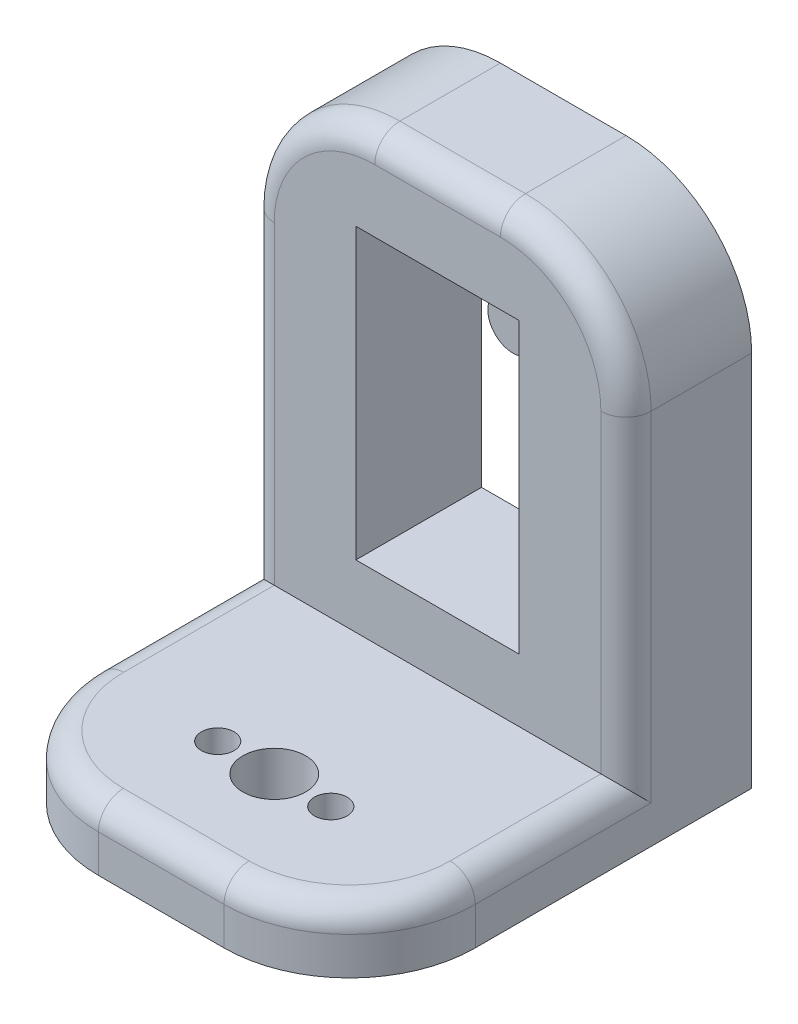
ISO-10303-21;
HEADER;
FILE_DESCRIPTION(('STEP AP214'),'2;1');
FILE_NAME('part.step','',(''),(''),'','','');
FILE_SCHEMA(('AUTOMOTIVE_DESIGN { 1 0 10303 214 1 1 1 1 }'));
ENDSEC;
DATA;
#1=APPLICATION_CONTEXT('core data for automotive mechanical design processes');
#2=APPLICATION_PROTOCOL_DEFINITION('international standard','automotive_design',2000,#1);
#3=PRODUCT_CONTEXT('',#1,'mechanical');
#4=PRODUCT('Part','Part','',(#3));
#5=PRODUCT_RELATED_PRODUCT_CATEGORY('part','',(#4));
#6=PRODUCT_DEFINITION_FORMATION('','',#4);
#7=PRODUCT_DEFINITION_CONTEXT('part definition',#1,'design');
#8=PRODUCT_DEFINITION('design','',#6,#7);
#9=PRODUCT_DEFINITION_SHAPE('','',#8);
#10=(LENGTH_UNIT() NAMED_UNIT(*) SI_UNIT(.MILLI.,.METRE.));
#11=(NAMED_UNIT(*) PLANE_ANGLE_UNIT() SI_UNIT($,.RADIAN.));
#12=(NAMED_UNIT(*) SI_UNIT($,.STERADIAN.) SOLID_ANGLE_UNIT());
#13=UNCERTAINTY_MEASURE_WITH_UNIT(LENGTH_MEASURE(1.E-05),#10,'distance_accuracy_value','');
#14=(GEOMETRIC_REPRESENTATION_CONTEXT(3) GLOBAL_UNCERTAINTY_ASSIGNED_CONTEXT((#13)) GLOBAL_UNIT_ASSIGNED_CONTEXT((#10,
#11,#12)) REPRESENTATION_CONTEXT('',''));
#15=CARTESIAN_POINT('',(0.,0.,0.));
#16=DIRECTION('',(0.,0.,1.));
#17=DIRECTION('',(1.,0.,0.));
#18=AXIS2_PLACEMENT_3D('',#15,#16,#17);
#19=CARTESIAN_POINT('',(15.,26.5,-34.));
#20=DIRECTION('',(0.,0.,-1.));
#21=DIRECTION('',(-1.,0.,0.));
#22=AXIS2_PLACEMENT_3D('',#19,#20,#21);
#23=CYLINDRICAL_SURFACE('',#22,2.);
#24=CARTESIAN_POINT('',(15.,26.5,-34.));
#25=DIRECTION('',(0.,0.,-1.));
#26=DIRECTION('',(-1.,0.,0.));
#27=AXIS2_PLACEMENT_3D('',#24,#25,#26);
#28=CIRCLE('',#27,2.);
#29=CARTESIAN_POINT('',(13.,26.5,-34.));
#30=VERTEX_POINT('',#29);
#31=EDGE_CURVE('E11',#30,#30,#28,.T.);
#32=ORIENTED_EDGE('',*,*,#31,.T.);
#33=EDGE_LOOP('',(#32));
#34=FACE_BOUND('',#33,.T.);
#35=CARTESIAN_POINT('',(15.,26.5,-38.));
#36=DIRECTION('',(0.,0.,-1.));
#37=DIRECTION('',(-1.,0.,0.));
#38=AXIS2_PLACEMENT_3D('',#35,#36,#37);
#39=CIRCLE('',#38,2.);
#40=CARTESIAN_POINT('',(13.,26.5,-38.));
#41=VERTEX_POINT('',#40);
#42=EDGE_CURVE('E47',#41,#41,#39,.T.);
#43=ORIENTED_EDGE('',*,*,#42,.F.);
#44=EDGE_LOOP('',(#43));
#45=FACE_BOUND('',#44,.T.);
#46=ADVANCED_FACE('F44',(#34,#45),#23,.T.);
#47=CARTESIAN_POINT('',(0.,0.,-34.));
#48=DIRECTION('',(0.,0.,-1.));
#49=DIRECTION('',(-1.,0.,0.));
#50=AXIS2_PLACEMENT_3D('',#47,#48,#49);
#51=PLANE('',#50);
#52=ORIENTED_EDGE('',*,*,#31,.F.);
#53=EDGE_LOOP('',(#52));
#54=FACE_BOUND('',#53,.T.);
#55=ADVANCED_FACE('F59',(#54),#51,.F.);
#56=CARTESIAN_POINT('',(0.,0.,-38.));
#57=DIRECTION('',(0.,0.,-1.));
#58=DIRECTION('',(-1.,0.,0.));
#59=AXIS2_PLACEMENT_3D('',#56,#57,#58);
#60=PLANE('',#59);
#61=ORIENTED_EDGE('',*,*,#42,.T.);
#62=EDGE_LOOP('',(#61));
#63=FACE_BOUND('',#62,.T.);
#64=ADVANCED_FACE('F56',(#63),#60,.T.);
#65=CLOSED_SHELL('',(#46,#55,#64));
#66=MANIFOLD_SOLID_BREP('B2',#65);
#67=CARTESIAN_POINT('',(-41.2310562561766,0.,-38.));
#68=DIRECTION('',(0.,0.,-1.));
#69=DIRECTION('',(-1.,0.,0.));
#70=AXIS2_PLACEMENT_3D('',#67,#68,#69);
#71=PLANE('',#70);
#72=CARTESIAN_POINT('',(15.,35.5,-38.));
#73=DIRECTION('',(0.,0.,-1.));
#74=DIRECTION('',(-1.,0.,0.));
#75=AXIS2_PLACEMENT_3D('',#72,#73,#74);
#76=CIRCLE('',#75,1.05);
#77=CARTESIAN_POINT('',(13.95,35.5,-38.));
#78=VERTEX_POINT('',#77);
#79=EDGE_CURVE('E246',#78,#78,#76,.T.);
#80=ORIENTED_EDGE('',*,*,#79,.F.);
#81=EDGE_LOOP('',(#80));
#82=FACE_BOUND('',#81,.T.);
#83=CARTESIAN_POINT('',(15.,7.5,-38.));
#84=DIRECTION('',(0.,0.,-1.));
#85=DIRECTION('',(-1.,0.,0.));
#86=AXIS2_PLACEMENT_3D('',#83,#84,#85);
#87=CIRCLE('',#86,1.05);
#88=CARTESIAN_POINT('',(13.95,7.5,-38.));
#89=VERTEX_POINT('',#88);
#90=EDGE_CURVE('E405',#89,#89,#87,.T.);
#91=ORIENTED_EDGE('',*,*,#90,.F.);
#92=EDGE_LOOP('',(#91));
#93=FACE_BOUND('',#92,.T.);
#94=DIRECTION('',(0.,1.,0.));
#95=VECTOR('',#94,1.);
#96=CARTESIAN_POINT('',(0.,0.,-38.));
#97=LINE('',#96,#95);
#98=CARTESIAN_POINT('',(0.,0.,-38.));
#99=VERTEX_POINT('',#98);
#100=CARTESIAN_POINT('',(0.,30.,-38.));
#101=VERTEX_POINT('',#100);
#102=EDGE_CURVE('E262',#99,#101,#97,.T.);
#103=ORIENTED_EDGE('',*,*,#102,.T.);
#104=CARTESIAN_POINT('',(10.,30.,-38.));
#105=DIRECTION('',(0.,0.,-1.));
#106=DIRECTION('',(-1.,0.,0.));
#107=AXIS2_PLACEMENT_3D('',#104,#105,#106);
#108=CIRCLE('',#107,10.);
#109=CARTESIAN_POINT('',(10.,40.,-38.));
#110=VERTEX_POINT('',#109);
#111=EDGE_CURVE('E314',#101,#110,#108,.T.);
#112=ORIENTED_EDGE('',*,*,#111,.T.);
#113=DIRECTION('',(1.,0.,0.));
#114=VECTOR('',#113,1.);
#115=CARTESIAN_POINT('',(-41.2310562561766,40.,-38.));
#116=LINE('',#115,#114);
#117=CARTESIAN_POINT('',(20.,40.,-38.));
#118=VERTEX_POINT('',#117);
#119=EDGE_CURVE('E265',#110,#118,#116,.T.);
#120=ORIENTED_EDGE('',*,*,#119,.T.);
#121=CARTESIAN_POINT('',(20.,30.,-38.));
#122=DIRECTION('',(0.,0.,-1.));
#123=DIRECTION('',(-1.,0.,0.));
#124=AXIS2_PLACEMENT_3D('',#121,#122,#123);
#125=CIRCLE('',#124,10.);
#126=CARTESIAN_POINT('',(30.,30.,-38.));
#127=VERTEX_POINT('',#126);
#128=EDGE_CURVE('E312',#118,#127,#125,.T.);
#129=ORIENTED_EDGE('',*,*,#128,.T.);
#130=DIRECTION('',(0.,1.,0.));
#131=VECTOR('',#130,1.);
#132=CARTESIAN_POINT('',(30.,0.,-38.));
#133=LINE('',#132,#131);
#134=CARTESIAN_POINT('',(30.,0.,-38.));
#135=VERTEX_POINT('',#134);
#136=EDGE_CURVE('E228',#135,#127,#133,.T.);
#137=ORIENTED_EDGE('',*,*,#136,.F.);
#138=DIRECTION('',(1.,0.,0.));
#139=VECTOR('',#138,1.);
#140=CARTESIAN_POINT('',(-41.2310562561766,0.,-38.));
#141=LINE('',#140,#139);
#142=EDGE_CURVE('E261',#99,#135,#141,.T.);
#143=ORIENTED_EDGE('',*,*,#142,.F.);
#144=EDGE_LOOP('',(#103,#112,#120,#129,#137,#143));
#145=FACE_BOUND('',#144,.T.);
#146=DIRECTION('',(0.,-1.,0.));
#147=VECTOR('',#146,1.);
#148=CARTESIAN_POINT('',(21.5,33.,-38.));
#149=LINE('',#148,#147);
#150=CARTESIAN_POINT('',(21.5,33.,-38.));
#151=VERTEX_POINT('',#150);
#152=CARTESIAN_POINT('',(21.5,10.,-38.));
#153=VERTEX_POINT('',#152);
#154=EDGE_CURVE('E242',#151,#153,#149,.T.);
#155=ORIENTED_EDGE('',*,*,#154,.F.);
#156=DIRECTION('',(-1.,0.,0.));
#157=VECTOR('',#156,1.);
#158=CARTESIAN_POINT('',(21.5,33.,-38.));
#159=LINE('',#158,#157);
#160=CARTESIAN_POINT('',(8.49999999999999,33.,-38.));
#161=VERTEX_POINT('',#160);
#162=EDGE_CURVE('E222',#151,#161,#159,.T.);
#163=ORIENTED_EDGE('',*,*,#162,.T.);
#164=DIRECTION('',(0.,-1.,0.));
#165=VECTOR('',#164,1.);
#166=CARTESIAN_POINT('',(8.49999999999999,33.,-38.));
#167=LINE('',#166,#165);
#168=CARTESIAN_POINT('',(8.49999999999999,9.99999999999999,-38.));
#169=VERTEX_POINT('',#168);
#170=EDGE_CURVE('E232',#161,#169,#167,.T.);
#171=ORIENTED_EDGE('',*,*,#170,.T.);
#172=DIRECTION('',(-1.,0.,0.));
#173=VECTOR('',#172,1.);
#174=CARTESIAN_POINT('',(21.5,10.,-38.));
#175=LINE('',#174,#173);
#176=EDGE_CURVE('E238',#153,#169,#175,.T.);
#177=ORIENTED_EDGE('',*,*,#176,.F.);
#178=EDGE_LOOP('',(#155,#163,#171,#177));
#179=FACE_BOUND('',#178,.T.);
#180=ADVANCED_FACE('F84',(#82,#93,#145,#179),#71,.T.);
#181=CARTESIAN_POINT('',(-41.2310562561766,0.,-28.));
#182=DIRECTION('',(0.,0.,1.));
#183=DIRECTION('',(1.,0.,0.));
#184=AXIS2_PLACEMENT_3D('',#181,#182,#183);
#185=PLANE('',#184);
#186=CARTESIAN_POINT('',(10.,30.,-28.));
#187=DIRECTION('',(0.,0.,1.));
#188=DIRECTION('',(1.,0.,0.));
#189=AXIS2_PLACEMENT_3D('',#186,#187,#188);
#190=CIRCLE('',#189,8.);
#191=CARTESIAN_POINT('',(10.,38.,-28.));
#192=VERTEX_POINT('',#191);
#193=CARTESIAN_POINT('',(2.,30.,-28.));
#194=VERTEX_POINT('',#193);
#195=EDGE_CURVE('E360',#192,#194,#190,.T.);
#196=ORIENTED_EDGE('',*,*,#195,.T.);
#197=DIRECTION('',(0.,-1.,0.));
#198=VECTOR('',#197,1.);
#199=CARTESIAN_POINT('',(2.,0.,-28.));
#200=LINE('',#199,#198);
#201=CARTESIAN_POINT('',(2.,5.,-28.));
#202=VERTEX_POINT('',#201);
#203=EDGE_CURVE('E362',#194,#202,#200,.T.);
#204=ORIENTED_EDGE('',*,*,#203,.T.);
#205=DIRECTION('',(1.,0.,0.));
#206=VECTOR('',#205,1.);
#207=CARTESIAN_POINT('',(0.,5.,-28.));
#208=LINE('',#207,#206);
#209=CARTESIAN_POINT('',(28.,5.,-28.));
#210=VERTEX_POINT('',#209);
#211=EDGE_CURVE('E268',#202,#210,#208,.T.);
#212=ORIENTED_EDGE('',*,*,#211,.T.);
#213=DIRECTION('',(0.,-1.,0.));
#214=VECTOR('',#213,1.);
#215=CARTESIAN_POINT('',(28.,30.,-28.));
#216=LINE('',#215,#214);
#217=CARTESIAN_POINT('',(28.,30.,-28.));
#218=VERTEX_POINT('',#217);
#219=EDGE_CURVE('E354',#210,#218,#216,.F.);
#220=ORIENTED_EDGE('',*,*,#219,.T.);
#221=CARTESIAN_POINT('',(20.,30.,-28.));
#222=DIRECTION('',(0.,0.,1.));
#223=DIRECTION('',(1.,0.,0.));
#224=AXIS2_PLACEMENT_3D('',#221,#222,#223);
#225=CIRCLE('',#224,8.);
#226=CARTESIAN_POINT('',(20.,38.,-28.));
#227=VERTEX_POINT('',#226);
#228=EDGE_CURVE('E356',#218,#227,#225,.T.);
#229=ORIENTED_EDGE('',*,*,#228,.T.);
#230=DIRECTION('',(1.,0.,0.));
#231=VECTOR('',#230,1.);
#232=CARTESIAN_POINT('',(-41.2310562561766,38.,-28.));
#233=LINE('',#232,#231);
#234=EDGE_CURVE('E358',#227,#192,#233,.F.);
#235=ORIENTED_EDGE('',*,*,#234,.T.);
#236=EDGE_LOOP('',(#196,#204,#212,#220,#229,#235));
#237=FACE_BOUND('',#236,.T.);
#238=DIRECTION('',(0.,1.,0.));
#239=VECTOR('',#238,1.);
#240=CARTESIAN_POINT('',(8.49999999999999,0.,-28.));
#241=LINE('',#240,#239);
#242=CARTESIAN_POINT('',(8.49999999999999,9.99999999999999,-28.));
#243=VERTEX_POINT('',#242);
#244=CARTESIAN_POINT('',(8.49999999999999,33.,-28.));
#245=VERTEX_POINT('',#244);
#246=EDGE_CURVE('E300',#243,#245,#241,.T.);
#247=ORIENTED_EDGE('',*,*,#246,.T.);
#248=DIRECTION('',(1.,0.,0.));
#249=VECTOR('',#248,1.);
#250=CARTESIAN_POINT('',(-41.2310562561766,33.,-28.));
#251=LINE('',#250,#249);
#252=CARTESIAN_POINT('',(21.5,33.,-28.));
#253=VERTEX_POINT('',#252);
#254=EDGE_CURVE('E225',#245,#253,#251,.T.);
#255=ORIENTED_EDGE('',*,*,#254,.T.);
#256=DIRECTION('',(0.,1.,0.));
#257=VECTOR('',#256,1.);
#258=CARTESIAN_POINT('',(21.5,0.,-28.));
#259=LINE('',#258,#257);
#260=CARTESIAN_POINT('',(21.5,10.,-28.));
#261=VERTEX_POINT('',#260);
#262=EDGE_CURVE('E284',#261,#253,#259,.T.);
#263=ORIENTED_EDGE('',*,*,#262,.F.);
#264=DIRECTION('',(1.,0.,0.));
#265=VECTOR('',#264,1.);
#266=CARTESIAN_POINT('',(-41.2310562561766,9.99999999999999,-28.));
#267=LINE('',#266,#265);
#268=EDGE_CURVE('E297',#243,#261,#267,.T.);
#269=ORIENTED_EDGE('',*,*,#268,.F.);
#270=EDGE_LOOP('',(#247,#255,#263,#269));
#271=FACE_BOUND('',#270,.T.);
#272=ADVANCED_FACE('F415',(#237,#271),#185,.T.);
#273=CARTESIAN_POINT('',(30.,5.,0.));
#274=DIRECTION('',(-1.,0.,0.));
#275=DIRECTION('',(0.,0.,1.));
#276=AXIS2_PLACEMENT_3D('',#273,#274,#275);
#277=PLANE('',#276);
#278=DIRECTION('',(0.,-1.,0.));
#279=VECTOR('',#278,1.);
#280=CARTESIAN_POINT('',(30.,5.,-30.));
#281=LINE('',#280,#279);
#282=CARTESIAN_POINT('',(30.,30.,-30.));
#283=VERTEX_POINT('',#282);
#284=CARTESIAN_POINT('',(30.,3.,-30.));
#285=VERTEX_POINT('',#284);
#286=EDGE_CURVE('E341',#283,#285,#281,.T.);
#287=ORIENTED_EDGE('',*,*,#286,.T.);
#288=DIRECTION('',(0.,0.,-1.));
#289=VECTOR('',#288,1.);
#290=CARTESIAN_POINT('',(30.,3.,-16.));
#291=LINE('',#290,#289);
#292=CARTESIAN_POINT('',(30.,3.,-16.));
#293=VERTEX_POINT('',#292);
#294=EDGE_CURVE('E343',#285,#293,#291,.F.);
#295=ORIENTED_EDGE('',*,*,#294,.T.);
#296=DIRECTION('',(0.,1.,0.));
#297=VECTOR('',#296,1.);
#298=CARTESIAN_POINT('',(30.,5.,-16.));
#299=LINE('',#298,#297);
#300=CARTESIAN_POINT('',(30.,0.,-16.));
#301=VERTEX_POINT('',#300);
#302=EDGE_CURVE('E316',#293,#301,#299,.F.);
#303=ORIENTED_EDGE('',*,*,#302,.T.);
#304=DIRECTION('',(0.,0.,-1.));
#305=VECTOR('',#304,1.);
#306=CARTESIAN_POINT('',(30.,0.,0.));
#307=LINE('',#306,#305);
#308=EDGE_CURVE('E293',#301,#135,#307,.T.);
#309=ORIENTED_EDGE('',*,*,#308,.T.);
#310=ORIENTED_EDGE('',*,*,#136,.T.);
#311=DIRECTION('',(0.,0.,1.));
#312=VECTOR('',#311,1.);
#313=CARTESIAN_POINT('',(30.,30.,-28.));
#314=LINE('',#313,#312);
#315=EDGE_CURVE('E318',#127,#283,#314,.T.);
#316=ORIENTED_EDGE('',*,*,#315,.T.);
#317=EDGE_LOOP('',(#287,#295,#303,#309,#310,#316));
#318=FACE_BOUND('',#317,.T.);
#319=ADVANCED_FACE('F444',(#318),#277,.F.);
#320=CARTESIAN_POINT('',(15.,5.,-15.));
#321=DIRECTION('',(0.,-1.,0.));
#322=DIRECTION('',(0.,0.,-1.));
#323=AXIS2_PLACEMENT_3D('',#320,#321,#322);
#324=CYLINDRICAL_SURFACE('',#323,2.5);
#325=CARTESIAN_POINT('',(15.,5.,-15.));
#326=DIRECTION('',(0.,1.,0.));
#327=DIRECTION('',(0.,0.,1.));
#328=AXIS2_PLACEMENT_3D('',#325,#326,#327);
#329=CIRCLE('',#328,2.5);
#330=CARTESIAN_POINT('',(15.,5.,-12.5));
#331=VERTEX_POINT('',#330);
#332=EDGE_CURVE('E281',#331,#331,#329,.T.);
#333=ORIENTED_EDGE('',*,*,#332,.T.);
#334=EDGE_LOOP('',(#333));
#335=FACE_BOUND('',#334,.T.);
#336=CARTESIAN_POINT('',(15.,0.,-15.));
#337=DIRECTION('',(0.,1.,0.));
#338=DIRECTION('',(0.,0.,1.));
#339=AXIS2_PLACEMENT_3D('',#336,#337,#338);
#340=CIRCLE('',#339,2.5);
#341=CARTESIAN_POINT('',(15.,0.,-12.5));
#342=VERTEX_POINT('',#341);
#343=EDGE_CURVE('E290',#342,#342,#340,.T.);
#344=ORIENTED_EDGE('',*,*,#343,.F.);
#345=EDGE_LOOP('',(#344));
#346=FACE_BOUND('',#345,.T.);
#347=ADVANCED_FACE('F539',(#335,#346),#324,.F.);
#348=CARTESIAN_POINT('',(10.5,5.,-15.));
#349=DIRECTION('',(0.,-1.,0.));
#350=DIRECTION('',(0.,0.,-1.));
#351=AXIS2_PLACEMENT_3D('',#348,#349,#350);
#352=CYLINDRICAL_SURFACE('',#351,1.3);
#353=CARTESIAN_POINT('',(10.5,5.,-15.));
#354=DIRECTION('',(0.,1.,0.));
#355=DIRECTION('',(0.,0.,1.));
#356=AXIS2_PLACEMENT_3D('',#353,#354,#355);
#357=CIRCLE('',#356,1.3);
#358=CARTESIAN_POINT('',(10.5,5.,-13.7));
#359=VERTEX_POINT('',#358);
#360=EDGE_CURVE('E277',#359,#359,#357,.T.);
#361=ORIENTED_EDGE('',*,*,#360,.T.);
#362=EDGE_LOOP('',(#361));
#363=FACE_BOUND('',#362,.T.);
#364=CARTESIAN_POINT('',(10.5,0.,-15.));
#365=DIRECTION('',(0.,1.,0.));
#366=DIRECTION('',(0.,0.,1.));
#367=AXIS2_PLACEMENT_3D('',#364,#365,#366);
#368=CIRCLE('',#367,1.3);
#369=CARTESIAN_POINT('',(10.5,0.,-13.7));
#370=VERTEX_POINT('',#369);
#371=EDGE_CURVE('E287',#370,#370,#368,.T.);
#372=ORIENTED_EDGE('',*,*,#371,.F.);
#373=EDGE_LOOP('',(#372));
#374=FACE_BOUND('',#373,.T.);
#375=ADVANCED_FACE('F542',(#363,#374),#352,.F.);
#376=CARTESIAN_POINT('',(19.5,5.,-15.));
#377=DIRECTION('',(0.,-1.,0.));
#378=DIRECTION('',(0.,0.,-1.));
#379=AXIS2_PLACEMENT_3D('',#376,#377,#378);
#380=CYLINDRICAL_SURFACE('',#379,1.3);
#381=CARTESIAN_POINT('',(19.5,5.,-15.));
#382=DIRECTION('',(0.,1.,0.));
#383=DIRECTION('',(0.,0.,1.));
#384=AXIS2_PLACEMENT_3D('',#381,#382,#383);
#385=CIRCLE('',#384,1.3);
#386=CARTESIAN_POINT('',(19.5,5.,-13.7));
#387=VERTEX_POINT('',#386);
#388=EDGE_CURVE('E274',#387,#387,#385,.T.);
#389=ORIENTED_EDGE('',*,*,#388,.T.);
#390=EDGE_LOOP('',(#389));
#391=FACE_BOUND('',#390,.T.);
#392=CARTESIAN_POINT('',(19.5,0.,-15.));
#393=DIRECTION('',(0.,1.,0.));
#394=DIRECTION('',(0.,0.,1.));
#395=AXIS2_PLACEMENT_3D('',#392,#393,#394);
#396=CIRCLE('',#395,1.3);
#397=CARTESIAN_POINT('',(19.5,0.,-13.7));
#398=VERTEX_POINT('',#397);
#399=EDGE_CURVE('E273',#398,#398,#396,.T.);
#400=ORIENTED_EDGE('',*,*,#399,.F.);
#401=EDGE_LOOP('',(#400));
#402=FACE_BOUND('',#401,.T.);
#403=ADVANCED_FACE('F536',(#391,#402),#380,.F.);
#404=CARTESIAN_POINT('',(0.,5.,0.));
#405=DIRECTION('',(-1.,0.,0.));
#406=DIRECTION('',(0.,0.,1.));
#407=AXIS2_PLACEMENT_3D('',#404,#405,#406);
#408=PLANE('',#407);
#409=DIRECTION('',(0.,1.,0.));
#410=VECTOR('',#409,1.);
#411=CARTESIAN_POINT('',(0.,5.,-16.));
#412=LINE('',#411,#410);
#413=CARTESIAN_POINT('',(0.,0.,-16.));
#414=VERTEX_POINT('',#413);
#415=CARTESIAN_POINT('',(0.,3.,-16.));
#416=VERTEX_POINT('',#415);
#417=EDGE_CURVE('E307',#414,#416,#412,.T.);
#418=ORIENTED_EDGE('',*,*,#417,.T.);
#419=DIRECTION('',(0.,0.,-1.));
#420=VECTOR('',#419,1.);
#421=CARTESIAN_POINT('',(0.,3.,0.));
#422=LINE('',#421,#420);
#423=CARTESIAN_POINT('',(0.,3.,-30.));
#424=VERTEX_POINT('',#423);
#425=EDGE_CURVE('E350',#416,#424,#422,.T.);
#426=ORIENTED_EDGE('',*,*,#425,.T.);
#427=DIRECTION('',(0.,-1.,0.));
#428=VECTOR('',#427,1.);
#429=CARTESIAN_POINT('',(0.,5.,-30.));
#430=LINE('',#429,#428);
#431=CARTESIAN_POINT('',(0.,30.,-30.));
#432=VERTEX_POINT('',#431);
#433=EDGE_CURVE('E348',#424,#432,#430,.F.);
#434=ORIENTED_EDGE('',*,*,#433,.T.);
#435=DIRECTION('',(0.,0.,1.));
#436=VECTOR('',#435,1.);
#437=CARTESIAN_POINT('',(0.,30.,0.));
#438=LINE('',#437,#436);
#439=EDGE_CURVE('E310',#432,#101,#438,.F.);
#440=ORIENTED_EDGE('',*,*,#439,.T.);
#441=ORIENTED_EDGE('',*,*,#102,.F.);
#442=DIRECTION('',(0.,0.,-1.));
#443=VECTOR('',#442,1.);
#444=CARTESIAN_POINT('',(0.,0.,0.));
#445=LINE('',#444,#443);
#446=EDGE_CURVE('E278',#414,#99,#445,.T.);
#447=ORIENTED_EDGE('',*,*,#446,.F.);
#448=EDGE_LOOP('',(#418,#426,#434,#440,#441,#447));
#449=FACE_BOUND('',#448,.T.);
#450=ADVANCED_FACE('F453',(#449),#408,.T.);
#451=CARTESIAN_POINT('',(0.,5.,0.));
#452=DIRECTION('',(0.,1.,0.));
#453=DIRECTION('',(0.,0.,1.));
#454=AXIS2_PLACEMENT_3D('',#451,#452,#453);
#455=PLANE('',#454);
#456=CARTESIAN_POINT('',(20.,5.,-16.));
#457=DIRECTION('',(0.,1.,0.));
#458=DIRECTION('',(0.,0.,1.));
#459=AXIS2_PLACEMENT_3D('',#456,#457,#458);
#460=CIRCLE('',#459,8.);
#461=CARTESIAN_POINT('',(20.,5.,-8.));
#462=VERTEX_POINT('',#461);
#463=CARTESIAN_POINT('',(28.,5.,-16.));
#464=VERTEX_POINT('',#463);
#465=EDGE_CURVE('E336',#462,#464,#460,.T.);
#466=ORIENTED_EDGE('',*,*,#465,.T.);
#467=DIRECTION('',(0.,0.,-1.));
#468=VECTOR('',#467,1.);
#469=CARTESIAN_POINT('',(28.,5.,-28.));
#470=LINE('',#469,#468);
#471=EDGE_CURVE('E338',#464,#210,#470,.T.);
#472=ORIENTED_EDGE('',*,*,#471,.T.);
#473=ORIENTED_EDGE('',*,*,#211,.F.);
#474=DIRECTION('',(0.,0.,-1.));
#475=VECTOR('',#474,1.);
#476=CARTESIAN_POINT('',(2.,5.,0.));
#477=LINE('',#476,#475);
#478=CARTESIAN_POINT('',(2.,5.,-16.));
#479=VERTEX_POINT('',#478);
#480=EDGE_CURVE('E334',#202,#479,#477,.F.);
#481=ORIENTED_EDGE('',*,*,#480,.T.);
#482=CARTESIAN_POINT('',(10.,5.,-16.));
#483=DIRECTION('',(0.,1.,0.));
#484=DIRECTION('',(0.,0.,1.));
#485=AXIS2_PLACEMENT_3D('',#482,#483,#484);
#486=CIRCLE('',#485,8.);
#487=CARTESIAN_POINT('',(10.,5.,-8.));
#488=VERTEX_POINT('',#487);
#489=EDGE_CURVE('E332',#479,#488,#486,.T.);
#490=ORIENTED_EDGE('',*,*,#489,.T.);
#491=DIRECTION('',(-1.,0.,0.));
#492=VECTOR('',#491,1.);
#493=CARTESIAN_POINT('',(20.,5.,-8.));
#494=LINE('',#493,#492);
#495=EDGE_CURVE('E330',#488,#462,#494,.F.);
#496=ORIENTED_EDGE('',*,*,#495,.T.);
#497=EDGE_LOOP('',(#466,#472,#473,#481,#490,#496));
#498=FACE_BOUND('',#497,.T.);
#499=ORIENTED_EDGE('',*,*,#388,.F.);
#500=EDGE_LOOP('',(#499));
#501=FACE_BOUND('',#500,.T.);
#502=ORIENTED_EDGE('',*,*,#360,.F.);
#503=EDGE_LOOP('',(#502));
#504=FACE_BOUND('',#503,.T.);
#505=ORIENTED_EDGE('',*,*,#332,.F.);
#506=EDGE_LOOP('',(#505));
#507=FACE_BOUND('',#506,.T.);
#508=ADVANCED_FACE('F470',(#498,#501,#504,#507),#455,.T.);
#509=CARTESIAN_POINT('',(0.,0.,0.));
#510=DIRECTION('',(0.,1.,0.));
#511=DIRECTION('',(0.,0.,1.));
#512=AXIS2_PLACEMENT_3D('',#509,#510,#511);
#513=PLANE('',#512);
#514=ORIENTED_EDGE('',*,*,#399,.T.);
#515=EDGE_LOOP('',(#514));
#516=FACE_BOUND('',#515,.T.);
#517=ORIENTED_EDGE('',*,*,#371,.T.);
#518=EDGE_LOOP('',(#517));
#519=FACE_BOUND('',#518,.T.);
#520=ORIENTED_EDGE('',*,*,#343,.T.);
#521=EDGE_LOOP('',(#520));
#522=FACE_BOUND('',#521,.T.);
#523=DIRECTION('',(1.,0.,0.));
#524=VECTOR('',#523,1.);
#525=CARTESIAN_POINT('',(0.,0.,-6.));
#526=LINE('',#525,#524);
#527=CARTESIAN_POINT('',(10.,0.,-6.));
#528=VERTEX_POINT('',#527);
#529=CARTESIAN_POINT('',(20.,0.,-6.));
#530=VERTEX_POINT('',#529);
#531=EDGE_CURVE('E394',#528,#530,#526,.T.);
#532=ORIENTED_EDGE('',*,*,#531,.F.);
#533=CARTESIAN_POINT('',(10.,0.,-16.));
#534=DIRECTION('',(0.,1.,0.));
#535=DIRECTION('',(0.,0.,1.));
#536=AXIS2_PLACEMENT_3D('',#533,#534,#535);
#537=CIRCLE('',#536,10.);
#538=EDGE_CURVE('E328',#528,#414,#537,.F.);
#539=ORIENTED_EDGE('',*,*,#538,.T.);
#540=ORIENTED_EDGE('',*,*,#446,.T.);
#541=ORIENTED_EDGE('',*,*,#142,.T.);
#542=ORIENTED_EDGE('',*,*,#308,.F.);
#543=CARTESIAN_POINT('',(20.,0.,-16.));
#544=DIRECTION('',(0.,1.,0.));
#545=DIRECTION('',(0.,0.,1.));
#546=AXIS2_PLACEMENT_3D('',#543,#544,#545);
#547=CIRCLE('',#546,10.);
#548=EDGE_CURVE('E326',#301,#530,#547,.F.);
#549=ORIENTED_EDGE('',*,*,#548,.T.);
#550=EDGE_LOOP('',(#532,#539,#540,#541,#542,#549));
#551=FACE_BOUND('',#550,.T.);
#552=ADVANCED_FACE('F450',(#516,#519,#522,#551),#513,.F.);
#553=CARTESIAN_POINT('',(-41.2310562561766,40.,-28.));
#554=DIRECTION('',(0.,1.,0.));
#555=DIRECTION('',(0.,0.,1.));
#556=AXIS2_PLACEMENT_3D('',#553,#554,#555);
#557=PLANE('',#556);
#558=DIRECTION('',(0.,0.,1.));
#559=VECTOR('',#558,1.);
#560=CARTESIAN_POINT('',(10.,40.,-28.));
#561=LINE('',#560,#559);
#562=CARTESIAN_POINT('',(10.,40.,-30.));
#563=VERTEX_POINT('',#562);
#564=EDGE_CURVE('E305',#110,#563,#561,.T.);
#565=ORIENTED_EDGE('',*,*,#564,.T.);
#566=DIRECTION('',(1.,0.,0.));
#567=VECTOR('',#566,1.);
#568=CARTESIAN_POINT('',(-41.2310562561766,40.,-30.));
#569=LINE('',#568,#567);
#570=CARTESIAN_POINT('',(20.,40.,-30.));
#571=VERTEX_POINT('',#570);
#572=EDGE_CURVE('E101',#563,#571,#569,.T.);
#573=ORIENTED_EDGE('',*,*,#572,.T.);
#574=DIRECTION('',(0.,0.,1.));
#575=VECTOR('',#574,1.);
#576=CARTESIAN_POINT('',(20.,40.,-38.));
#577=LINE('',#576,#575);
#578=EDGE_CURVE('E303',#571,#118,#577,.F.);
#579=ORIENTED_EDGE('',*,*,#578,.T.);
#580=ORIENTED_EDGE('',*,*,#119,.F.);
#581=EDGE_LOOP('',(#565,#573,#579,#580));
#582=FACE_BOUND('',#581,.T.);
#583=ADVANCED_FACE('F427',(#582),#557,.T.);
#584=CARTESIAN_POINT('',(21.5,33.,0.));
#585=DIRECTION('',(0.,-1.,0.));
#586=DIRECTION('',(0.,0.,-1.));
#587=AXIS2_PLACEMENT_3D('',#584,#585,#586);
#588=PLANE('',#587);
#589=DIRECTION('',(0.,0.,-1.));
#590=VECTOR('',#589,1.);
#591=CARTESIAN_POINT('',(8.49999999999999,33.,0.));
#592=LINE('',#591,#590);
#593=EDGE_CURVE('E217',#245,#161,#592,.T.);
#594=ORIENTED_EDGE('',*,*,#593,.T.);
#595=ORIENTED_EDGE('',*,*,#162,.F.);
#596=DIRECTION('',(0.,0.,-1.));
#597=VECTOR('',#596,1.);
#598=CARTESIAN_POINT('',(21.5,33.,0.));
#599=LINE('',#598,#597);
#600=EDGE_CURVE('E254',#253,#151,#599,.T.);
#601=ORIENTED_EDGE('',*,*,#600,.F.);
#602=ORIENTED_EDGE('',*,*,#254,.F.);
#603=EDGE_LOOP('',(#594,#595,#601,#602));
#604=FACE_BOUND('',#603,.T.);
#605=ADVANCED_FACE('F219',(#604),#588,.T.);
#606=CARTESIAN_POINT('',(8.49999999999999,33.,0.));
#607=DIRECTION('',(1.,0.,0.));
#608=DIRECTION('',(0.,1.,0.));
#609=AXIS2_PLACEMENT_3D('',#606,#607,#608);
#610=PLANE('',#609);
#611=DIRECTION('',(0.,0.,-1.));
#612=VECTOR('',#611,1.);
#613=CARTESIAN_POINT('',(8.49999999999999,9.99999999999999,0.));
#614=LINE('',#613,#612);
#615=EDGE_CURVE('E229',#243,#169,#614,.T.);
#616=ORIENTED_EDGE('',*,*,#615,.T.);
#617=ORIENTED_EDGE('',*,*,#170,.F.);
#618=ORIENTED_EDGE('',*,*,#593,.F.);
#619=ORIENTED_EDGE('',*,*,#246,.F.);
#620=EDGE_LOOP('',(#616,#617,#618,#619));
#621=FACE_BOUND('',#620,.T.);
#622=ADVANCED_FACE('F233',(#621),#610,.T.);
#623=CARTESIAN_POINT('',(21.5,10.,0.));
#624=DIRECTION('',(0.,-1.,0.));
#625=DIRECTION('',(1.,0.,0.));
#626=AXIS2_PLACEMENT_3D('',#623,#624,#625);
#627=PLANE('',#626);
#628=ORIENTED_EDGE('',*,*,#268,.T.);
#629=DIRECTION('',(0.,0.,-1.));
#630=VECTOR('',#629,1.);
#631=CARTESIAN_POINT('',(21.5,10.,0.));
#632=LINE('',#631,#630);
#633=EDGE_CURVE('E256',#261,#153,#632,.T.);
#634=ORIENTED_EDGE('',*,*,#633,.T.);
#635=ORIENTED_EDGE('',*,*,#176,.T.);
#636=ORIENTED_EDGE('',*,*,#615,.F.);
#637=EDGE_LOOP('',(#628,#634,#635,#636));
#638=FACE_BOUND('',#637,.T.);
#639=ADVANCED_FACE('F516',(#638),#627,.F.);
#640=CARTESIAN_POINT('',(21.5,33.,0.));
#641=DIRECTION('',(1.,0.,0.));
#642=DIRECTION('',(0.,1.,0.));
#643=AXIS2_PLACEMENT_3D('',#640,#641,#642);
#644=PLANE('',#643);
#645=ORIENTED_EDGE('',*,*,#262,.T.);
#646=ORIENTED_EDGE('',*,*,#600,.T.);
#647=ORIENTED_EDGE('',*,*,#154,.T.);
#648=ORIENTED_EDGE('',*,*,#633,.F.);
#649=EDGE_LOOP('',(#645,#646,#647,#648));
#650=FACE_BOUND('',#649,.T.);
#651=ADVANCED_FACE('F509',(#650),#644,.F.);
#652=CARTESIAN_POINT('',(15.,7.5,-30.));
#653=DIRECTION('',(0.,0.,-1.));
#654=DIRECTION('',(-1.,0.,0.));
#655=AXIS2_PLACEMENT_3D('',#652,#653,#654);
#656=CYLINDRICAL_SURFACE('',#655,1.05);
#657=CARTESIAN_POINT('',(15.,7.5,-30.));
#658=DIRECTION('',(0.,0.,-1.));
#659=DIRECTION('',(-1.,0.,0.));
#660=AXIS2_PLACEMENT_3D('',#657,#658,#659);
#661=CIRCLE('',#660,1.05);
#662=CARTESIAN_POINT('',(13.95,7.5,-30.));
#663=VERTEX_POINT('',#662);
#664=EDGE_CURVE('E249',#663,#663,#661,.T.);
#665=ORIENTED_EDGE('',*,*,#664,.F.);
#666=EDGE_LOOP('',(#665));
#667=FACE_BOUND('',#666,.T.);
#668=ORIENTED_EDGE('',*,*,#90,.T.);
#669=EDGE_LOOP('',(#668));
#670=FACE_BOUND('',#669,.T.);
#671=ADVANCED_FACE('F411',(#667,#670),#656,.F.);
#672=CARTESIAN_POINT('',(15.,7.5,-30.));
#673=DIRECTION('',(0.,0.,-1.));
#674=DIRECTION('',(-1.,0.,0.));
#675=AXIS2_PLACEMENT_3D('',#672,#673,#674);
#676=PLANE('',#675);
#677=ORIENTED_EDGE('',*,*,#664,.T.);
#678=EDGE_LOOP('',(#677));
#679=FACE_BOUND('',#678,.T.);
#680=ADVANCED_FACE('F505',(#679),#676,.T.);
#681=CARTESIAN_POINT('',(15.,35.5,-30.));
#682=DIRECTION('',(0.,0.,-1.));
#683=DIRECTION('',(-1.,0.,0.));
#684=AXIS2_PLACEMENT_3D('',#681,#682,#683);
#685=CYLINDRICAL_SURFACE('',#684,1.05);
#686=CARTESIAN_POINT('',(15.,35.5,-30.));
#687=DIRECTION('',(0.,0.,-1.));
#688=DIRECTION('',(-1.,0.,0.));
#689=AXIS2_PLACEMENT_3D('',#686,#687,#688);
#690=CIRCLE('',#689,1.05);
#691=CARTESIAN_POINT('',(13.95,35.5,-30.));
#692=VERTEX_POINT('',#691);
#693=EDGE_CURVE('E243',#692,#692,#690,.T.);
#694=ORIENTED_EDGE('',*,*,#693,.F.);
#695=EDGE_LOOP('',(#694));
#696=FACE_BOUND('',#695,.T.);
#697=ORIENTED_EDGE('',*,*,#79,.T.);
#698=EDGE_LOOP('',(#697));
#699=FACE_BOUND('',#698,.T.);
#700=ADVANCED_FACE('F499',(#696,#699),#685,.F.);
#701=CARTESIAN_POINT('',(15.,35.5,-30.));
#702=DIRECTION('',(0.,0.,-1.));
#703=DIRECTION('',(-1.,0.,0.));
#704=AXIS2_PLACEMENT_3D('',#701,#702,#703);
#705=PLANE('',#704);
#706=ORIENTED_EDGE('',*,*,#693,.T.);
#707=EDGE_LOOP('',(#706));
#708=FACE_BOUND('',#707,.T.);
#709=ADVANCED_FACE('F492',(#708),#705,.T.);
#710=CARTESIAN_POINT('',(0.,-0.00100000000000013,-6.));
#711=DIRECTION('',(0.,0.,-1.));
#712=DIRECTION('',(-1.,0.,0.));
#713=AXIS2_PLACEMENT_3D('',#710,#711,#712);
#714=PLANE('',#713);
#715=DIRECTION('',(0.,1.,0.));
#716=VECTOR('',#715,1.);
#717=CARTESIAN_POINT('',(20.,-0.00100000000000013,-6.));
#718=LINE('',#717,#716);
#719=CARTESIAN_POINT('',(20.,3.,-6.));
#720=VERTEX_POINT('',#719);
#721=EDGE_CURVE('E321',#530,#720,#718,.T.);
#722=ORIENTED_EDGE('',*,*,#721,.T.);
#723=DIRECTION('',(-1.,0.,0.));
#724=VECTOR('',#723,1.);
#725=CARTESIAN_POINT('',(10.,3.,-6.));
#726=LINE('',#725,#724);
#727=CARTESIAN_POINT('',(10.,3.,-6.));
#728=VERTEX_POINT('',#727);
#729=EDGE_CURVE('E42',#720,#728,#726,.T.);
#730=ORIENTED_EDGE('',*,*,#729,.T.);
#731=DIRECTION('',(0.,1.,0.));
#732=VECTOR('',#731,1.);
#733=CARTESIAN_POINT('',(10.,0.,-6.));
#734=LINE('',#733,#732);
#735=EDGE_CURVE('E324',#728,#528,#734,.F.);
#736=ORIENTED_EDGE('',*,*,#735,.T.);
#737=ORIENTED_EDGE('',*,*,#531,.T.);
#738=EDGE_LOOP('',(#722,#730,#736,#737));
#739=FACE_BOUND('',#738,.T.);
#740=ADVANCED_FACE('F490',(#739),#714,.F.);
#741=CARTESIAN_POINT('',(10.,30.,-28.));
#742=DIRECTION('',(0.,0.,1.));
#743=DIRECTION('',(1.,0.,0.));
#744=AXIS2_PLACEMENT_3D('',#741,#742,#743);
#745=CYLINDRICAL_SURFACE('',#744,10.);
#746=ORIENTED_EDGE('',*,*,#439,.F.);
#747=CARTESIAN_POINT('',(10.,30.,-30.));
#748=DIRECTION('',(0.,0.,1.));
#749=DIRECTION('',(1.,0.,0.));
#750=AXIS2_PLACEMENT_3D('',#747,#748,#749);
#751=CIRCLE('',#750,10.);
#752=EDGE_CURVE('E109',#432,#563,#751,.F.);
#753=ORIENTED_EDGE('',*,*,#752,.T.);
#754=ORIENTED_EDGE('',*,*,#564,.F.);
#755=ORIENTED_EDGE('',*,*,#111,.F.);
#756=EDGE_LOOP('',(#746,#753,#754,#755));
#757=FACE_BOUND('',#756,.T.);
#758=ADVANCED_FACE('F425',(#757),#745,.T.);
#759=CARTESIAN_POINT('',(20.,30.,0.));
#760=DIRECTION('',(0.,0.,-1.));
#761=DIRECTION('',(-1.,0.,0.));
#762=AXIS2_PLACEMENT_3D('',#759,#760,#761);
#763=CYLINDRICAL_SURFACE('',#762,10.);
#764=ORIENTED_EDGE('',*,*,#578,.F.);
#765=CARTESIAN_POINT('',(20.,30.,-30.));
#766=DIRECTION('',(0.,0.,1.));
#767=DIRECTION('',(1.,0.,0.));
#768=AXIS2_PLACEMENT_3D('',#765,#766,#767);
#769=CIRCLE('',#768,10.);
#770=EDGE_CURVE('E93',#571,#283,#769,.F.);
#771=ORIENTED_EDGE('',*,*,#770,.T.);
#772=ORIENTED_EDGE('',*,*,#315,.F.);
#773=ORIENTED_EDGE('',*,*,#128,.F.);
#774=EDGE_LOOP('',(#764,#771,#772,#773));
#775=FACE_BOUND('',#774,.T.);
#776=ADVANCED_FACE('F441',(#775),#763,.T.);
#777=CARTESIAN_POINT('',(10.,5.,-16.));
#778=DIRECTION('',(0.,-1.,0.));
#779=DIRECTION('',(0.,0.,-1.));
#780=AXIS2_PLACEMENT_3D('',#777,#778,#779);
#781=CYLINDRICAL_SURFACE('',#780,10.);
#782=ORIENTED_EDGE('',*,*,#735,.F.);
#783=CARTESIAN_POINT('',(10.,3.,-16.));
#784=DIRECTION('',(0.,1.,0.));
#785=DIRECTION('',(0.,0.,1.));
#786=AXIS2_PLACEMENT_3D('',#783,#784,#785);
#787=CIRCLE('',#786,10.);
#788=EDGE_CURVE('E352',#728,#416,#787,.F.);
#789=ORIENTED_EDGE('',*,*,#788,.T.);
#790=ORIENTED_EDGE('',*,*,#417,.F.);
#791=ORIENTED_EDGE('',*,*,#538,.F.);
#792=EDGE_LOOP('',(#782,#789,#790,#791));
#793=FACE_BOUND('',#792,.T.);
#794=ADVANCED_FACE('F456',(#793),#781,.T.);
#795=CARTESIAN_POINT('',(20.,-0.00100000000000013,-16.));
#796=DIRECTION('',(0.,1.,0.));
#797=DIRECTION('',(0.,0.,1.));
#798=AXIS2_PLACEMENT_3D('',#795,#796,#797);
#799=CYLINDRICAL_SURFACE('',#798,10.);
#800=ORIENTED_EDGE('',*,*,#302,.F.);
#801=CARTESIAN_POINT('',(20.,3.,-16.));
#802=DIRECTION('',(0.,1.,0.));
#803=DIRECTION('',(0.,0.,1.));
#804=AXIS2_PLACEMENT_3D('',#801,#802,#803);
#805=CIRCLE('',#804,10.);
#806=EDGE_CURVE('E346',#293,#720,#805,.F.);
#807=ORIENTED_EDGE('',*,*,#806,.T.);
#808=ORIENTED_EDGE('',*,*,#721,.F.);
#809=ORIENTED_EDGE('',*,*,#548,.F.);
#810=EDGE_LOOP('',(#800,#807,#808,#809));
#811=FACE_BOUND('',#810,.T.);
#812=ADVANCED_FACE('F489',(#811),#799,.T.);
#813=CARTESIAN_POINT('',(2.,0.,-30.));
#814=DIRECTION('',(0.,-1.,0.));
#815=DIRECTION('',(0.,0.,-1.));
#816=AXIS2_PLACEMENT_3D('',#813,#814,#815);
#817=CYLINDRICAL_SURFACE('',#816,2.);
#818=CARTESIAN_POINT('',(2.,30.,-30.));
#819=DIRECTION('',(0.,1.,0.));
#820=DIRECTION('',(0.,0.,1.));
#821=AXIS2_PLACEMENT_3D('',#818,#819,#820);
#822=CIRCLE('',#821,2.);
#823=EDGE_CURVE('E388',#432,#194,#822,.T.);
#824=ORIENTED_EDGE('',*,*,#823,.F.);
#825=ORIENTED_EDGE('',*,*,#433,.F.);
#826=CARTESIAN_POINT('',(2.,3.,-30.));
#827=DIRECTION('',(0.,0.707106781186547,-0.707106781186547));
#828=DIRECTION('',(0.,-0.707106781186547,-0.707106781186547));
#829=AXIS2_PLACEMENT_3D('',#826,#827,#828);
#830=ELLIPSE('',#829,2.82842712474619,2.);
#831=EDGE_CURVE('E88',#202,#424,#830,.F.);
#832=ORIENTED_EDGE('',*,*,#831,.F.);
#833=ORIENTED_EDGE('',*,*,#203,.F.);
#834=EDGE_LOOP('',(#824,#825,#832,#833));
#835=FACE_BOUND('',#834,.T.);
#836=ADVANCED_FACE('F86',(#835),#817,.T.);
#837=CARTESIAN_POINT('',(2.,3.,0.));
#838=DIRECTION('',(0.,0.,-1.));
#839=DIRECTION('',(-1.,0.,0.));
#840=AXIS2_PLACEMENT_3D('',#837,#838,#839);
#841=CYLINDRICAL_SURFACE('',#840,2.);
#842=ORIENTED_EDGE('',*,*,#831,.T.);
#843=ORIENTED_EDGE('',*,*,#425,.F.);
#844=CARTESIAN_POINT('',(2.,3.,-16.));
#845=DIRECTION('',(0.,0.,1.));
#846=DIRECTION('',(1.,0.,0.));
#847=AXIS2_PLACEMENT_3D('',#844,#845,#846);
#848=CIRCLE('',#847,2.);
#849=EDGE_CURVE('E386',#479,#416,#848,.T.);
#850=ORIENTED_EDGE('',*,*,#849,.F.);
#851=ORIENTED_EDGE('',*,*,#480,.F.);
#852=EDGE_LOOP('',(#842,#843,#850,#851));
#853=FACE_BOUND('',#852,.T.);
#854=ADVANCED_FACE('F474',(#853),#841,.T.);
#855=CARTESIAN_POINT('',(10.,30.,-30.));
#856=DIRECTION('',(0.,0.,1.));
#857=DIRECTION('',(1.,0.,0.));
#858=AXIS2_PLACEMENT_3D('',#855,#856,#857);
#859=TOROIDAL_SURFACE('',#858,8.,2.);
#860=ORIENTED_EDGE('',*,*,#823,.T.);
#861=ORIENTED_EDGE('',*,*,#195,.F.);
#862=CARTESIAN_POINT('',(10.,38.,-30.));
#863=DIRECTION('',(1.,0.,0.));
#864=DIRECTION('',(0.,0.,-1.));
#865=AXIS2_PLACEMENT_3D('',#862,#863,#864);
#866=CIRCLE('',#865,2.);
#867=EDGE_CURVE('E383',#563,#192,#866,.T.);
#868=ORIENTED_EDGE('',*,*,#867,.F.);
#869=ORIENTED_EDGE('',*,*,#752,.F.);
#870=EDGE_LOOP('',(#860,#861,#868,#869));
#871=FACE_BOUND('',#870,.T.);
#872=ADVANCED_FACE('F428',(#871),#859,.T.);
#873=CARTESIAN_POINT('',(10.,3.,-16.));
#874=DIRECTION('',(0.,1.,0.));
#875=DIRECTION('',(0.,0.,1.));
#876=AXIS2_PLACEMENT_3D('',#873,#874,#875);
#877=TOROIDAL_SURFACE('',#876,8.,2.);
#878=ORIENTED_EDGE('',*,*,#849,.T.);
#879=ORIENTED_EDGE('',*,*,#788,.F.);
#880=CARTESIAN_POINT('',(10.,3.,-8.));
#881=DIRECTION('',(1.,0.,0.));
#882=DIRECTION('',(0.,0.,-1.));
#883=AXIS2_PLACEMENT_3D('',#880,#881,#882);
#884=CIRCLE('',#883,2.);
#885=EDGE_CURVE('E380',#488,#728,#884,.T.);
#886=ORIENTED_EDGE('',*,*,#885,.F.);
#887=ORIENTED_EDGE('',*,*,#489,.F.);
#888=EDGE_LOOP('',(#878,#879,#886,#887));
#889=FACE_BOUND('',#888,.T.);
#890=ADVANCED_FACE('F460',(#889),#877,.T.);
#891=CARTESIAN_POINT('',(-41.2310562561766,38.,-30.));
#892=DIRECTION('',(1.,0.,0.));
#893=DIRECTION('',(0.,0.,-1.));
#894=AXIS2_PLACEMENT_3D('',#891,#892,#893);
#895=CYLINDRICAL_SURFACE('',#894,2.);
#896=ORIENTED_EDGE('',*,*,#867,.T.);
#897=ORIENTED_EDGE('',*,*,#234,.F.);
#898=CARTESIAN_POINT('',(20.,38.,-30.));
#899=DIRECTION('',(1.,0.,0.));
#900=DIRECTION('',(0.,0.,-1.));
#901=AXIS2_PLACEMENT_3D('',#898,#899,#900);
#902=CIRCLE('',#901,2.);
#903=EDGE_CURVE('E377',#571,#227,#902,.T.);
#904=ORIENTED_EDGE('',*,*,#903,.F.);
#905=ORIENTED_EDGE('',*,*,#572,.F.);
#906=EDGE_LOOP('',(#896,#897,#904,#905));
#907=FACE_BOUND('',#906,.T.);
#908=ADVANCED_FACE('F432',(#907),#895,.T.);
#909=CARTESIAN_POINT('',(0.,3.,-8.));
#910=DIRECTION('',(1.,0.,0.));
#911=DIRECTION('',(0.,0.,-1.));
#912=AXIS2_PLACEMENT_3D('',#909,#910,#911);
#913=CYLINDRICAL_SURFACE('',#912,2.);
#914=ORIENTED_EDGE('',*,*,#885,.T.);
#915=ORIENTED_EDGE('',*,*,#729,.F.);
#916=CARTESIAN_POINT('',(20.,3.,-8.));
#917=DIRECTION('',(1.,0.,0.));
#918=DIRECTION('',(0.,0.,-1.));
#919=AXIS2_PLACEMENT_3D('',#916,#917,#918);
#920=CIRCLE('',#919,2.);
#921=EDGE_CURVE('E374',#462,#720,#920,.T.);
#922=ORIENTED_EDGE('',*,*,#921,.F.);
#923=ORIENTED_EDGE('',*,*,#495,.F.);
#924=EDGE_LOOP('',(#914,#915,#922,#923));
#925=FACE_BOUND('',#924,.T.);
#926=ADVANCED_FACE('F466',(#925),#913,.T.);
#927=CARTESIAN_POINT('',(20.,30.,-30.));
#928=DIRECTION('',(0.,0.,1.));
#929=DIRECTION('',(1.,0.,0.));
#930=AXIS2_PLACEMENT_3D('',#927,#928,#929);
#931=TOROIDAL_SURFACE('',#930,8.,2.);
#932=ORIENTED_EDGE('',*,*,#903,.T.);
#933=ORIENTED_EDGE('',*,*,#228,.F.);
#934=CARTESIAN_POINT('',(28.,30.,-30.));
#935=DIRECTION('',(0.,-1.,0.));
#936=DIRECTION('',(0.,0.,-1.));
#937=AXIS2_PLACEMENT_3D('',#934,#935,#936);
#938=CIRCLE('',#937,2.);
#939=EDGE_CURVE('E371',#283,#218,#938,.T.);
#940=ORIENTED_EDGE('',*,*,#939,.F.);
#941=ORIENTED_EDGE('',*,*,#770,.F.);
#942=EDGE_LOOP('',(#932,#933,#940,#941));
#943=FACE_BOUND('',#942,.T.);
#944=ADVANCED_FACE('F437',(#943),#931,.T.);
#945=CARTESIAN_POINT('',(20.,3.,-16.));
#946=DIRECTION('',(0.,1.,0.));
#947=DIRECTION('',(0.,0.,1.));
#948=AXIS2_PLACEMENT_3D('',#945,#946,#947);
#949=TOROIDAL_SURFACE('',#948,8.,2.);
#950=ORIENTED_EDGE('',*,*,#921,.T.);
#951=ORIENTED_EDGE('',*,*,#806,.F.);
#952=CARTESIAN_POINT('',(28.,3.,-16.));
#953=DIRECTION('',(0.,0.,-1.));
#954=DIRECTION('',(-1.,0.,0.));
#955=AXIS2_PLACEMENT_3D('',#952,#953,#954);
#956=CIRCLE('',#955,2.);
#957=EDGE_CURVE('E369',#464,#293,#956,.T.);
#958=ORIENTED_EDGE('',*,*,#957,.F.);
#959=ORIENTED_EDGE('',*,*,#465,.F.);
#960=EDGE_LOOP('',(#950,#951,#958,#959));
#961=FACE_BOUND('',#960,.T.);
#962=ADVANCED_FACE('F560',(#961),#949,.T.);
#963=CARTESIAN_POINT('',(28.,5.,-30.));
#964=DIRECTION('',(0.,1.,0.));
#965=DIRECTION('',(0.,0.,1.));
#966=AXIS2_PLACEMENT_3D('',#963,#964,#965);
#967=CYLINDRICAL_SURFACE('',#966,2.);
#968=ORIENTED_EDGE('',*,*,#939,.T.);
#969=ORIENTED_EDGE('',*,*,#219,.F.);
#970=CARTESIAN_POINT('',(28.,3.,-30.));
#971=DIRECTION('',(0.,-0.707106781186547,0.707106781186547));
#972=DIRECTION('',(0.,0.707106781186547,0.707106781186547));
#973=AXIS2_PLACEMENT_3D('',#970,#971,#972);
#974=ELLIPSE('',#973,2.82842712474619,2.);
#975=EDGE_CURVE('E367',#285,#210,#974,.T.);
#976=ORIENTED_EDGE('',*,*,#975,.F.);
#977=ORIENTED_EDGE('',*,*,#286,.F.);
#978=EDGE_LOOP('',(#968,#969,#976,#977));
#979=FACE_BOUND('',#978,.T.);
#980=ADVANCED_FACE('F482',(#979),#967,.T.);
#981=CARTESIAN_POINT('',(28.,3.,0.));
#982=DIRECTION('',(0.,0.,1.));
#983=DIRECTION('',(1.,0.,0.));
#984=AXIS2_PLACEMENT_3D('',#981,#982,#983);
#985=CYLINDRICAL_SURFACE('',#984,2.);
#986=ORIENTED_EDGE('',*,*,#957,.T.);
#987=ORIENTED_EDGE('',*,*,#294,.F.);
#988=ORIENTED_EDGE('',*,*,#975,.T.);
#989=ORIENTED_EDGE('',*,*,#471,.F.);
#990=EDGE_LOOP('',(#986,#987,#988,#989));
#991=FACE_BOUND('',#990,.T.);
#992=ADVANCED_FACE('F486',(#991),#985,.T.);
#993=CLOSED_SHELL('',(#180,#272,#319,#347,#375,#403,#450,#508,#552,#583,#605,#622,#639,#651,
#671,#680,#700,#709,#740,#758,#776,#794,#812,#836,#854,#872,#890,#908,#926,#944,#962,#980,#992));
#994=MANIFOLD_SOLID_BREP('B6',#993);
#995=ADVANCED_BREP_SHAPE_REPRESENTATION('',(#18,#66,#994),#14);
#996=SHAPE_DEFINITION_REPRESENTATION(#9,#995);
ENDSEC;
END-ISO-10303-21;
